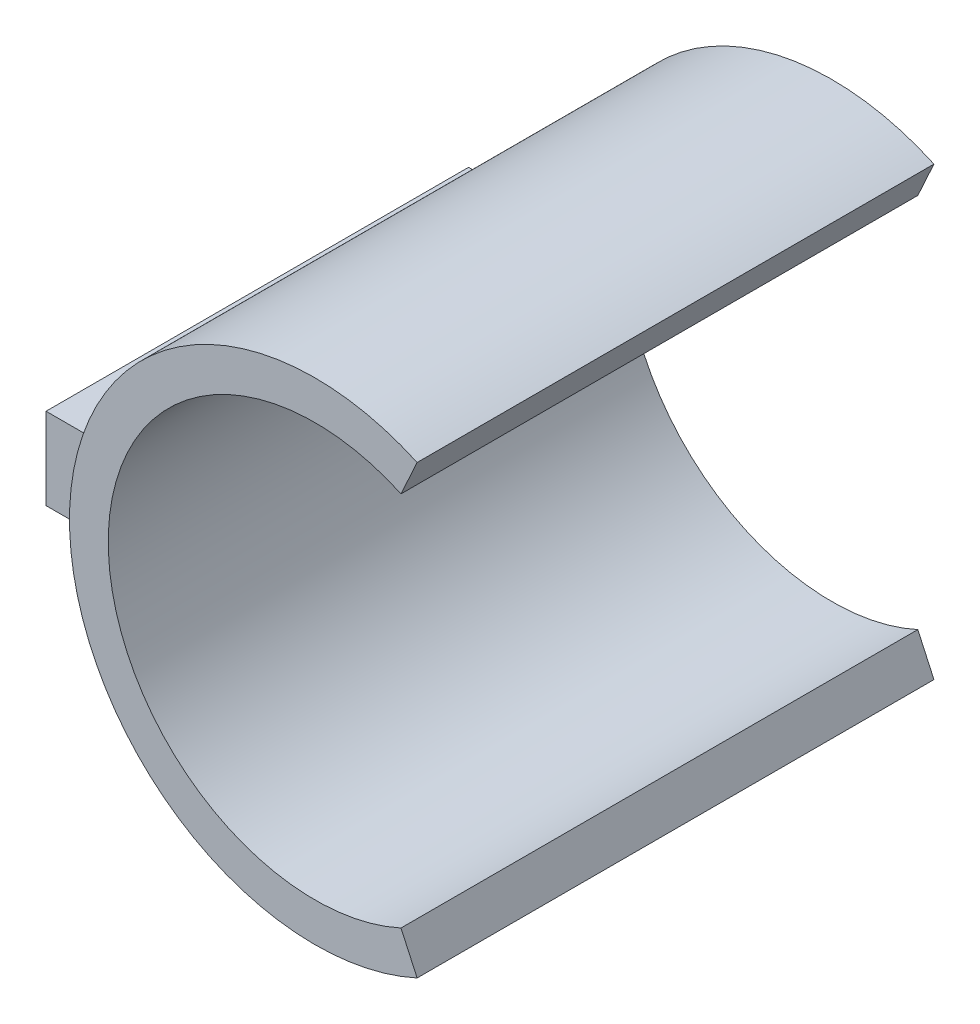
ISO-10303-21;
HEADER;
FILE_DESCRIPTION(('STEP AP214'),'2;1');
FILE_NAME('part.step','',(''),(''),'','','');
FILE_SCHEMA(('AUTOMOTIVE_DESIGN { 1 0 10303 214 1 1 1 1 }'));
ENDSEC;
DATA;
#1=APPLICATION_CONTEXT('core data for automotive mechanical design processes');
#2=APPLICATION_PROTOCOL_DEFINITION('international standard','automotive_design',2000,#1);
#3=PRODUCT_CONTEXT('',#1,'mechanical');
#4=PRODUCT('Part','Part','',(#3));
#5=PRODUCT_RELATED_PRODUCT_CATEGORY('part','',(#4));
#6=PRODUCT_DEFINITION_FORMATION('','',#4);
#7=PRODUCT_DEFINITION_CONTEXT('part definition',#1,'design');
#8=PRODUCT_DEFINITION('design','',#6,#7);
#9=PRODUCT_DEFINITION_SHAPE('','',#8);
#10=(LENGTH_UNIT() NAMED_UNIT(*) SI_UNIT(.MILLI.,.METRE.));
#11=(NAMED_UNIT(*) PLANE_ANGLE_UNIT() SI_UNIT($,.RADIAN.));
#12=(NAMED_UNIT(*) SI_UNIT($,.STERADIAN.) SOLID_ANGLE_UNIT());
#13=UNCERTAINTY_MEASURE_WITH_UNIT(LENGTH_MEASURE(1.E-05),#10,'distance_accuracy_value','');
#14=(GEOMETRIC_REPRESENTATION_CONTEXT(3) GLOBAL_UNCERTAINTY_ASSIGNED_CONTEXT((#13)) GLOBAL_UNIT_ASSIGNED_CONTEXT((#10,
#11,#12)) REPRESENTATION_CONTEXT('',''));
#15=CARTESIAN_POINT('',(0.,0.,0.));
#16=DIRECTION('',(0.,0.,1.));
#17=DIRECTION('',(1.,0.,0.));
#18=AXIS2_PLACEMENT_3D('',#15,#16,#17);
#19=CARTESIAN_POINT('',(0.,0.,10.));
#20=DIRECTION('',(0.,0.,1.));
#21=DIRECTION('',(1.,0.,0.));
#22=AXIS2_PLACEMENT_3D('',#19,#20,#21);
#23=PLANE('',#22);
#24=CARTESIAN_POINT('',(0.,0.,10.));
#25=DIRECTION('',(0.,0.,1.));
#26=DIRECTION('',(1.,0.,0.));
#27=AXIS2_PLACEMENT_3D('',#24,#25,#26);
#28=CIRCLE('',#27,4.);
#29=CARTESIAN_POINT('',(1.66450102978228,3.63722920941941,10.));
#30=VERTEX_POINT('',#29);
#31=CARTESIAN_POINT('',(1.66450102978228,-3.63722920941941,10.));
#32=VERTEX_POINT('',#31);
#33=EDGE_CURVE('E163',#30,#32,#28,.T.);
#34=ORIENTED_EDGE('',*,*,#33,.F.);
#35=DIRECTION('',(0.416125257445571,0.909307302354852,0.));
#36=VECTOR('',#35,1.);
#37=CARTESIAN_POINT('',(0.,0.,10.));
#38=LINE('',#37,#36);
#39=CARTESIAN_POINT('',(1.97659497286646,4.31920968618554,10.));
#40=VERTEX_POINT('',#39);
#41=EDGE_CURVE('E140',#30,#40,#38,.T.);
#42=ORIENTED_EDGE('',*,*,#41,.T.);
#43=CARTESIAN_POINT('',(0.,0.,10.));
#44=DIRECTION('',(0.,0.,1.));
#45=DIRECTION('',(1.,0.,0.));
#46=AXIS2_PLACEMENT_3D('',#43,#44,#45);
#47=CIRCLE('',#46,4.75);
#48=CARTESIAN_POINT('',(1.97659497286646,-4.31920968618554,10.));
#49=VERTEX_POINT('',#48);
#50=EDGE_CURVE('E169',#40,#49,#47,.T.);
#51=ORIENTED_EDGE('',*,*,#50,.T.);
#52=DIRECTION('',(0.416125257445571,-0.909307302354852,0.));
#53=VECTOR('',#52,1.);
#54=CARTESIAN_POINT('',(0.,0.,10.));
#55=LINE('',#54,#53);
#56=EDGE_CURVE('E147',#32,#49,#55,.T.);
#57=ORIENTED_EDGE('',*,*,#56,.F.);
#58=EDGE_LOOP('',(#34,#42,#51,#57));
#59=FACE_BOUND('',#58,.T.);
#60=ADVANCED_FACE('F49',(#59),#23,.T.);
#61=CARTESIAN_POINT('',(0.,0.,0.));
#62=DIRECTION('',(0.,0.,1.));
#63=DIRECTION('',(1.,0.,0.));
#64=AXIS2_PLACEMENT_3D('',#61,#62,#63);
#65=PLANE('',#64);
#66=DIRECTION('',(0.416125257445571,0.909307302354852,0.));
#67=VECTOR('',#66,1.);
#68=CARTESIAN_POINT('',(0.,0.,0.));
#69=LINE('',#68,#67);
#70=CARTESIAN_POINT('',(1.66450102978228,3.63722920941941,0.));
#71=VERTEX_POINT('',#70);
#72=CARTESIAN_POINT('',(1.97659497286646,4.31920968618554,0.));
#73=VERTEX_POINT('',#72);
#74=EDGE_CURVE('E145',#71,#73,#69,.T.);
#75=ORIENTED_EDGE('',*,*,#74,.F.);
#76=CARTESIAN_POINT('',(0.,0.,0.));
#77=DIRECTION('',(0.,0.,1.));
#78=DIRECTION('',(1.,0.,0.));
#79=AXIS2_PLACEMENT_3D('',#76,#77,#78);
#80=CIRCLE('',#79,4.);
#81=CARTESIAN_POINT('',(1.66450102978228,-3.63722920941941,0.));
#82=VERTEX_POINT('',#81);
#83=EDGE_CURVE('E155',#71,#82,#80,.T.);
#84=ORIENTED_EDGE('',*,*,#83,.T.);
#85=DIRECTION('',(0.416125257445571,-0.909307302354852,0.));
#86=VECTOR('',#85,1.);
#87=CARTESIAN_POINT('',(0.,0.,0.));
#88=LINE('',#87,#86);
#89=CARTESIAN_POINT('',(1.97659497286646,-4.31920968618554,0.));
#90=VERTEX_POINT('',#89);
#91=EDGE_CURVE('E72',#82,#90,#88,.T.);
#92=ORIENTED_EDGE('',*,*,#91,.T.);
#93=CARTESIAN_POINT('',(0.,0.,0.));
#94=DIRECTION('',(0.,0.,1.));
#95=DIRECTION('',(1.,0.,0.));
#96=AXIS2_PLACEMENT_3D('',#93,#94,#95);
#97=CIRCLE('',#96,4.75);
#98=EDGE_CURVE('E166',#73,#90,#97,.T.);
#99=ORIENTED_EDGE('',*,*,#98,.F.);
#100=EDGE_LOOP('',(#75,#84,#92,#99));
#101=FACE_BOUND('',#100,.T.);
#102=ADVANCED_FACE('F195',(#101),#65,.F.);
#103=CARTESIAN_POINT('',(0.,0.,10.));
#104=DIRECTION('',(0.,0.,-1.));
#105=DIRECTION('',(-1.,0.,0.));
#106=AXIS2_PLACEMENT_3D('',#103,#104,#105);
#107=CYLINDRICAL_SURFACE('',#106,4.75);
#108=DIRECTION('',(0.,0.,-1.));
#109=VECTOR('',#108,1.);
#110=CARTESIAN_POINT('',(-4.68367972325629,-0.790976769543761,10.));
#111=LINE('',#110,#109);
#112=CARTESIAN_POINT('',(-4.68367972325629,-0.790976769543761,9.20343436429505));
#113=VERTEX_POINT('',#112);
#114=CARTESIAN_POINT('',(-4.68367972325629,-0.790976769543761,1.0292679224051));
#115=VERTEX_POINT('',#114);
#116=EDGE_CURVE('E57',#113,#115,#111,.T.);
#117=ORIENTED_EDGE('',*,*,#116,.T.);
#118=CARTESIAN_POINT('',(0.,0.,1.0292679224051));
#119=DIRECTION('',(0.,0.,-1.));
#120=DIRECTION('',(-1.,0.,0.));
#121=AXIS2_PLACEMENT_3D('',#118,#119,#120);
#122=CIRCLE('',#121,4.75);
#123=CARTESIAN_POINT('',(-4.68361952008899,0.791333173221886,1.0292679224051));
#124=VERTEX_POINT('',#123);
#125=EDGE_CURVE('E13',#115,#124,#122,.T.);
#126=ORIENTED_EDGE('',*,*,#125,.T.);
#127=DIRECTION('',(0.,0.,-1.));
#128=VECTOR('',#127,1.);
#129=CARTESIAN_POINT('',(-4.68361952008899,0.791333173221886,10.));
#130=LINE('',#129,#128);
#131=CARTESIAN_POINT('',(-4.68361952008899,0.791333173221886,9.20343436429505));
#132=VERTEX_POINT('',#131);
#133=EDGE_CURVE('E117',#124,#132,#130,.F.);
#134=ORIENTED_EDGE('',*,*,#133,.T.);
#135=CARTESIAN_POINT('',(0.,0.,9.20343436429505));
#136=DIRECTION('',(0.,0.,1.));
#137=DIRECTION('',(1.,0.,0.));
#138=AXIS2_PLACEMENT_3D('',#135,#136,#137);
#139=CIRCLE('',#138,4.75);
#140=EDGE_CURVE('E175',#132,#113,#139,.T.);
#141=ORIENTED_EDGE('',*,*,#140,.T.);
#142=EDGE_LOOP('',(#117,#126,#134,#141));
#143=FACE_BOUND('',#142,.T.);
#144=DIRECTION('',(0.,0.,1.));
#145=VECTOR('',#144,1.);
#146=CARTESIAN_POINT('',(1.97659497286646,4.31920968618554,0.));
#147=LINE('',#146,#145);
#148=EDGE_CURVE('E153',#73,#40,#147,.T.);
#149=ORIENTED_EDGE('',*,*,#148,.F.);
#150=ORIENTED_EDGE('',*,*,#98,.T.);
#151=DIRECTION('',(0.,0.,1.));
#152=VECTOR('',#151,1.);
#153=CARTESIAN_POINT('',(1.97659497286646,-4.31920968618554,0.));
#154=LINE('',#153,#152);
#155=EDGE_CURVE('E156',#90,#49,#154,.T.);
#156=ORIENTED_EDGE('',*,*,#155,.T.);
#157=ORIENTED_EDGE('',*,*,#50,.F.);
#158=EDGE_LOOP('',(#149,#150,#156,#157));
#159=FACE_BOUND('',#158,.T.);
#160=ADVANCED_FACE('F51',(#143,#159),#107,.T.);
#161=CARTESIAN_POINT('',(0.,0.,10.));
#162=DIRECTION('',(0.,0.,-1.));
#163=DIRECTION('',(-1.,0.,0.));
#164=AXIS2_PLACEMENT_3D('',#161,#162,#163);
#165=CYLINDRICAL_SURFACE('',#164,4.);
#166=ORIENTED_EDGE('',*,*,#83,.F.);
#167=DIRECTION('',(0.,0.,1.));
#168=VECTOR('',#167,1.);
#169=CARTESIAN_POINT('',(1.66450102978228,3.63722920941941,0.));
#170=LINE('',#169,#168);
#171=EDGE_CURVE('E149',#71,#30,#170,.T.);
#172=ORIENTED_EDGE('',*,*,#171,.T.);
#173=ORIENTED_EDGE('',*,*,#33,.T.);
#174=DIRECTION('',(0.,0.,1.));
#175=VECTOR('',#174,1.);
#176=CARTESIAN_POINT('',(1.66450102978228,-3.63722920941941,0.));
#177=LINE('',#176,#175);
#178=EDGE_CURVE('E159',#82,#32,#177,.T.);
#179=ORIENTED_EDGE('',*,*,#178,.F.);
#180=EDGE_LOOP('',(#166,#172,#173,#179));
#181=FACE_BOUND('',#180,.T.);
#182=ADVANCED_FACE('F204',(#181),#165,.F.);
#183=CARTESIAN_POINT('',(0.,0.,0.));
#184=DIRECTION('',(-0.909307302354851,-0.416125257445571,0.));
#185=DIRECTION('',(0.416125257445571,-0.909307302354851,0.));
#186=AXIS2_PLACEMENT_3D('',#183,#184,#185);
#187=PLANE('',#186);
#188=ORIENTED_EDGE('',*,*,#56,.T.);
#189=ORIENTED_EDGE('',*,*,#155,.F.);
#190=ORIENTED_EDGE('',*,*,#91,.F.);
#191=ORIENTED_EDGE('',*,*,#178,.T.);
#192=EDGE_LOOP('',(#188,#189,#190,#191));
#193=FACE_BOUND('',#192,.T.);
#194=ADVANCED_FACE('F207',(#193),#187,.F.);
#195=CARTESIAN_POINT('',(0.,0.,0.));
#196=DIRECTION('',(0.909307302354851,-0.416125257445571,0.));
#197=DIRECTION('',(0.416125257445571,0.909307302354851,0.));
#198=AXIS2_PLACEMENT_3D('',#195,#196,#197);
#199=PLANE('',#198);
#200=ORIENTED_EDGE('',*,*,#41,.F.);
#201=ORIENTED_EDGE('',*,*,#171,.F.);
#202=ORIENTED_EDGE('',*,*,#74,.T.);
#203=ORIENTED_EDGE('',*,*,#148,.T.);
#204=EDGE_LOOP('',(#200,#201,#202,#203));
#205=FACE_BOUND('',#204,.T.);
#206=ADVANCED_FACE('F209',(#205),#199,.T.);
#207=CARTESIAN_POINT('',(-6.,-0.790976769543761,1.0292679224051));
#208=DIRECTION('',(0.,-1.,0.));
#209=DIRECTION('',(0.,0.,-1.));
#210=AXIS2_PLACEMENT_3D('',#207,#208,#209);
#211=PLANE('',#210);
#212=ORIENTED_EDGE('',*,*,#116,.F.);
#213=DIRECTION('',(1.,0.,0.));
#214=VECTOR('',#213,1.);
#215=CARTESIAN_POINT('',(-6.,-0.790976769543761,9.20343436429505));
#216=LINE('',#215,#214);
#217=CARTESIAN_POINT('',(-6.,-0.790976769543761,9.20343436429505));
#218=VERTEX_POINT('',#217);
#219=EDGE_CURVE('E141',#218,#113,#216,.T.);
#220=ORIENTED_EDGE('',*,*,#219,.F.);
#221=DIRECTION('',(0.,0.,-1.));
#222=VECTOR('',#221,1.);
#223=CARTESIAN_POINT('',(-6.,-0.790976769543761,1.0292679224051));
#224=LINE('',#223,#222);
#225=CARTESIAN_POINT('',(-6.,-0.790976769543761,1.0292679224051));
#226=VERTEX_POINT('',#225);
#227=EDGE_CURVE('E120',#218,#226,#224,.T.);
#228=ORIENTED_EDGE('',*,*,#227,.T.);
#229=DIRECTION('',(1.,0.,0.));
#230=VECTOR('',#229,1.);
#231=CARTESIAN_POINT('',(-6.,-0.790976769543761,1.0292679224051));
#232=LINE('',#231,#230);
#233=EDGE_CURVE('E134',#226,#115,#232,.T.);
#234=ORIENTED_EDGE('',*,*,#233,.T.);
#235=EDGE_LOOP('',(#212,#220,#228,#234));
#236=FACE_BOUND('',#235,.T.);
#237=ADVANCED_FACE('F181',(#236),#211,.T.);
#238=CARTESIAN_POINT('',(-6.,0.791333173221886,1.0292679224051));
#239=DIRECTION('',(0.,1.,0.));
#240=DIRECTION('',(0.,0.,1.));
#241=AXIS2_PLACEMENT_3D('',#238,#239,#240);
#242=PLANE('',#241);
#243=ORIENTED_EDGE('',*,*,#133,.F.);
#244=DIRECTION('',(1.,0.,0.));
#245=VECTOR('',#244,1.);
#246=CARTESIAN_POINT('',(-6.,0.791333173221886,1.0292679224051));
#247=LINE('',#246,#245);
#248=CARTESIAN_POINT('',(-6.,0.791333173221886,1.0292679224051));
#249=VERTEX_POINT('',#248);
#250=EDGE_CURVE('E112',#249,#124,#247,.T.);
#251=ORIENTED_EDGE('',*,*,#250,.F.);
#252=DIRECTION('',(0.,0.,1.));
#253=VECTOR('',#252,1.);
#254=CARTESIAN_POINT('',(-6.,0.791333173221886,1.0292679224051));
#255=LINE('',#254,#253);
#256=CARTESIAN_POINT('',(-6.,0.791333173221886,9.20343436429505));
#257=VERTEX_POINT('',#256);
#258=EDGE_CURVE('E115',#249,#257,#255,.T.);
#259=ORIENTED_EDGE('',*,*,#258,.T.);
#260=DIRECTION('',(1.,0.,0.));
#261=VECTOR('',#260,1.);
#262=CARTESIAN_POINT('',(-6.,0.791333173221886,9.20343436429505));
#263=LINE('',#262,#261);
#264=EDGE_CURVE('E64',#257,#132,#263,.T.);
#265=ORIENTED_EDGE('',*,*,#264,.T.);
#266=EDGE_LOOP('',(#243,#251,#259,#265));
#267=FACE_BOUND('',#266,.T.);
#268=ADVANCED_FACE('F114',(#267),#242,.T.);
#269=CARTESIAN_POINT('',(-6.,0.791333173221886,1.0292679224051));
#270=DIRECTION('',(0.,0.,-1.));
#271=DIRECTION('',(-1.,0.,0.));
#272=AXIS2_PLACEMENT_3D('',#269,#270,#271);
#273=PLANE('',#272);
#274=ORIENTED_EDGE('',*,*,#125,.F.);
#275=ORIENTED_EDGE('',*,*,#233,.F.);
#276=DIRECTION('',(0.,1.,0.));
#277=VECTOR('',#276,1.);
#278=CARTESIAN_POINT('',(-6.,0.791333173221886,1.0292679224051));
#279=LINE('',#278,#277);
#280=EDGE_CURVE('E127',#226,#249,#279,.T.);
#281=ORIENTED_EDGE('',*,*,#280,.T.);
#282=ORIENTED_EDGE('',*,*,#250,.T.);
#283=EDGE_LOOP('',(#274,#275,#281,#282));
#284=FACE_BOUND('',#283,.T.);
#285=ADVANCED_FACE('F132',(#284),#273,.T.);
#286=CARTESIAN_POINT('',(-6.,0.791333173221886,9.20343436429505));
#287=DIRECTION('',(0.,0.,1.));
#288=DIRECTION('',(1.,0.,0.));
#289=AXIS2_PLACEMENT_3D('',#286,#287,#288);
#290=PLANE('',#289);
#291=ORIENTED_EDGE('',*,*,#140,.F.);
#292=ORIENTED_EDGE('',*,*,#264,.F.);
#293=DIRECTION('',(0.,-1.,0.));
#294=VECTOR('',#293,1.);
#295=CARTESIAN_POINT('',(-6.,0.791333173221886,9.20343436429505));
#296=LINE('',#295,#294);
#297=EDGE_CURVE('E130',#257,#218,#296,.T.);
#298=ORIENTED_EDGE('',*,*,#297,.T.);
#299=ORIENTED_EDGE('',*,*,#219,.T.);
#300=EDGE_LOOP('',(#291,#292,#298,#299));
#301=FACE_BOUND('',#300,.T.);
#302=ADVANCED_FACE('F183',(#301),#290,.T.);
#303=CARTESIAN_POINT('',(-6.,0.,0.));
#304=DIRECTION('',(-1.,0.,0.));
#305=DIRECTION('',(0.,0.,1.));
#306=AXIS2_PLACEMENT_3D('',#303,#304,#305);
#307=PLANE('',#306);
#308=ORIENTED_EDGE('',*,*,#280,.F.);
#309=ORIENTED_EDGE('',*,*,#227,.F.);
#310=ORIENTED_EDGE('',*,*,#297,.F.);
#311=ORIENTED_EDGE('',*,*,#258,.F.);
#312=EDGE_LOOP('',(#308,#309,#310,#311));
#313=FACE_BOUND('',#312,.T.);
#314=ADVANCED_FACE('F125',(#313),#307,.T.);
#315=CLOSED_SHELL('',(#60,#102,#160,#182,#194,#206,#237,#268,#285,#302,#314));
#316=MANIFOLD_SOLID_BREP('B2',#315);
#317=ADVANCED_BREP_SHAPE_REPRESENTATION('',(#18,#316),#14);
#318=SHAPE_DEFINITION_REPRESENTATION(#9,#317);
ENDSEC;
END-ISO-10303-21;
